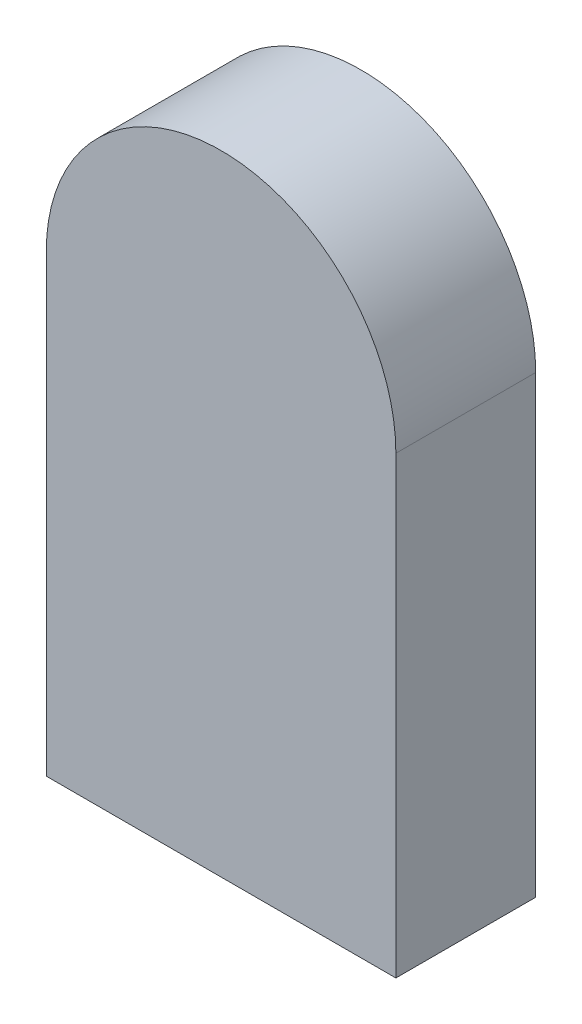
ISO-10303-21;
HEADER;
FILE_DESCRIPTION(('STEP AP214'),'2;1');
FILE_NAME('part.step','',(''),(''),'','','');
FILE_SCHEMA(('AUTOMOTIVE_DESIGN { 1 0 10303 214 1 1 1 1 }'));
ENDSEC;
DATA;
#1=APPLICATION_CONTEXT('core data for automotive mechanical design processes');
#2=APPLICATION_PROTOCOL_DEFINITION('international standard','automotive_design',2000,#1);
#3=PRODUCT_CONTEXT('',#1,'mechanical');
#4=PRODUCT('Part','Part','',(#3));
#5=PRODUCT_RELATED_PRODUCT_CATEGORY('part','',(#4));
#6=PRODUCT_DEFINITION_FORMATION('','',#4);
#7=PRODUCT_DEFINITION_CONTEXT('part definition',#1,'design');
#8=PRODUCT_DEFINITION('design','',#6,#7);
#9=PRODUCT_DEFINITION_SHAPE('','',#8);
#10=(LENGTH_UNIT() NAMED_UNIT(*) SI_UNIT(.MILLI.,.METRE.));
#11=(NAMED_UNIT(*) PLANE_ANGLE_UNIT() SI_UNIT($,.RADIAN.));
#12=(NAMED_UNIT(*) SI_UNIT($,.STERADIAN.) SOLID_ANGLE_UNIT());
#13=UNCERTAINTY_MEASURE_WITH_UNIT(LENGTH_MEASURE(1.E-05),#10,'distance_accuracy_value','');
#14=(GEOMETRIC_REPRESENTATION_CONTEXT(3) GLOBAL_UNCERTAINTY_ASSIGNED_CONTEXT((#13)) GLOBAL_UNIT_ASSIGNED_CONTEXT((#10,
#11,#12)) REPRESENTATION_CONTEXT('',''));
#15=CARTESIAN_POINT('',(0.,0.,0.));
#16=DIRECTION('',(0.,0.,1.));
#17=DIRECTION('',(1.,0.,0.));
#18=AXIS2_PLACEMENT_3D('',#15,#16,#17);
#19=CARTESIAN_POINT('',(-0.375,-2.05,0.));
#20=DIRECTION('',(0.,1.,0.));
#21=DIRECTION('',(1.,0.,0.));
#22=AXIS2_PLACEMENT_3D('',#19,#20,#21);
#23=PLANE('',#22);
#24=DIRECTION('',(1.,0.,0.));
#25=VECTOR('',#24,1.);
#26=CARTESIAN_POINT('',(-0.375,-2.05,0.));
#27=LINE('',#26,#25);
#28=CARTESIAN_POINT('',(-0.375,-2.05,0.));
#29=VERTEX_POINT('',#28);
#30=CARTESIAN_POINT('',(-0.125,-2.05,0.));
#31=VERTEX_POINT('',#30);
#32=EDGE_CURVE('E11',#29,#31,#27,.T.);
#33=ORIENTED_EDGE('',*,*,#32,.T.);
#34=DIRECTION('',(0.,0.,1.));
#35=VECTOR('',#34,1.);
#36=CARTESIAN_POINT('',(-0.125,-2.05,0.));
#37=LINE('',#36,#35);
#38=CARTESIAN_POINT('',(-0.125,-2.05,0.1));
#39=VERTEX_POINT('',#38);
#40=EDGE_CURVE('E24',#31,#39,#37,.T.);
#41=ORIENTED_EDGE('',*,*,#40,.T.);
#42=DIRECTION('',(1.,0.,0.));
#43=VECTOR('',#42,1.);
#44=CARTESIAN_POINT('',(-0.375,-2.05,0.1));
#45=LINE('',#44,#43);
#46=CARTESIAN_POINT('',(-0.375,-2.05,0.1));
#47=VERTEX_POINT('',#46);
#48=EDGE_CURVE('E87',#47,#39,#45,.T.);
#49=ORIENTED_EDGE('',*,*,#48,.F.);
#50=DIRECTION('',(0.,0.,1.));
#51=VECTOR('',#50,1.);
#52=CARTESIAN_POINT('',(-0.375,-2.05,0.));
#53=LINE('',#52,#51);
#54=EDGE_CURVE('E36',#29,#47,#53,.T.);
#55=ORIENTED_EDGE('',*,*,#54,.F.);
#56=EDGE_LOOP('',(#33,#41,#49,#55));
#57=FACE_BOUND('',#56,.T.);
#58=ADVANCED_FACE('F17',(#57),#23,.F.);
#59=CARTESIAN_POINT('',(-0.125,-2.05,0.));
#60=DIRECTION('',(-1.,0.,0.));
#61=DIRECTION('',(0.,1.,0.));
#62=AXIS2_PLACEMENT_3D('',#59,#60,#61);
#63=PLANE('',#62);
#64=DIRECTION('',(0.,1.,0.));
#65=VECTOR('',#64,1.);
#66=CARTESIAN_POINT('',(-0.125,-2.05,0.));
#67=LINE('',#66,#65);
#68=CARTESIAN_POINT('',(-0.125,-1.725,0.));
#69=VERTEX_POINT('',#68);
#70=EDGE_CURVE('E84',#31,#69,#67,.T.);
#71=ORIENTED_EDGE('',*,*,#70,.T.);
#72=DIRECTION('',(0.,0.,1.));
#73=VECTOR('',#72,1.);
#74=CARTESIAN_POINT('',(-0.125,-1.725,0.));
#75=LINE('',#74,#73);
#76=CARTESIAN_POINT('',(-0.125,-1.725,0.1));
#77=VERTEX_POINT('',#76);
#78=EDGE_CURVE('E82',#69,#77,#75,.T.);
#79=ORIENTED_EDGE('',*,*,#78,.T.);
#80=DIRECTION('',(0.,1.,0.));
#81=VECTOR('',#80,1.);
#82=CARTESIAN_POINT('',(-0.125,-2.05,0.1));
#83=LINE('',#82,#81);
#84=EDGE_CURVE('E72',#39,#77,#83,.T.);
#85=ORIENTED_EDGE('',*,*,#84,.F.);
#86=ORIENTED_EDGE('',*,*,#40,.F.);
#87=EDGE_LOOP('',(#71,#79,#85,#86));
#88=FACE_BOUND('',#87,.T.);
#89=ADVANCED_FACE('F89',(#88),#63,.F.);
#90=CARTESIAN_POINT('',(-0.25,-1.725,0.));
#91=DIRECTION('',(0.,0.,-1.));
#92=DIRECTION('',(1.,0.,0.));
#93=AXIS2_PLACEMENT_3D('',#90,#91,#92);
#94=CYLINDRICAL_SURFACE('',#93,0.125);
#95=CARTESIAN_POINT('',(-0.25,-1.725,0.));
#96=DIRECTION('',(0.,0.,1.));
#97=DIRECTION('',(1.,0.,0.));
#98=AXIS2_PLACEMENT_3D('',#95,#96,#97);
#99=CIRCLE('',#98,0.125);
#100=CARTESIAN_POINT('',(-0.375,-1.725,0.));
#101=VERTEX_POINT('',#100);
#102=EDGE_CURVE('E62',#69,#101,#99,.T.);
#103=ORIENTED_EDGE('',*,*,#102,.T.);
#104=DIRECTION('',(0.,0.,1.));
#105=VECTOR('',#104,1.);
#106=CARTESIAN_POINT('',(-0.375,-1.725,0.));
#107=LINE('',#106,#105);
#108=CARTESIAN_POINT('',(-0.375,-1.725,0.1));
#109=VERTEX_POINT('',#108);
#110=EDGE_CURVE('E57',#101,#109,#107,.T.);
#111=ORIENTED_EDGE('',*,*,#110,.T.);
#112=CARTESIAN_POINT('',(-0.25,-1.725,0.1));
#113=DIRECTION('',(0.,0.,1.));
#114=DIRECTION('',(1.,0.,0.));
#115=AXIS2_PLACEMENT_3D('',#112,#113,#114);
#116=CIRCLE('',#115,0.125);
#117=EDGE_CURVE('E60',#77,#109,#116,.T.);
#118=ORIENTED_EDGE('',*,*,#117,.F.);
#119=ORIENTED_EDGE('',*,*,#78,.F.);
#120=EDGE_LOOP('',(#103,#111,#118,#119));
#121=FACE_BOUND('',#120,.T.);
#122=ADVANCED_FACE('F59',(#121),#94,.T.);
#123=CARTESIAN_POINT('',(-0.375,-2.05,0.));
#124=DIRECTION('',(-1.,0.,0.));
#125=DIRECTION('',(0.,1.,0.));
#126=AXIS2_PLACEMENT_3D('',#123,#124,#125);
#127=PLANE('',#126);
#128=ORIENTED_EDGE('',*,*,#54,.T.);
#129=DIRECTION('',(0.,1.,0.));
#130=VECTOR('',#129,1.);
#131=CARTESIAN_POINT('',(-0.375,-2.05,0.1));
#132=LINE('',#131,#130);
#133=EDGE_CURVE('E71',#47,#109,#132,.T.);
#134=ORIENTED_EDGE('',*,*,#133,.T.);
#135=ORIENTED_EDGE('',*,*,#110,.F.);
#136=DIRECTION('',(0.,1.,0.));
#137=VECTOR('',#136,1.);
#138=CARTESIAN_POINT('',(-0.375,-2.05,0.));
#139=LINE('',#138,#137);
#140=EDGE_CURVE('E76',#29,#101,#139,.T.);
#141=ORIENTED_EDGE('',*,*,#140,.F.);
#142=EDGE_LOOP('',(#128,#134,#135,#141));
#143=FACE_BOUND('',#142,.T.);
#144=ADVANCED_FACE('F75',(#143),#127,.T.);
#145=CARTESIAN_POINT('',(-0.25,-1.850342514613,0.));
#146=DIRECTION('',(0.,0.,1.));
#147=DIRECTION('',(1.,0.,0.));
#148=AXIS2_PLACEMENT_3D('',#145,#146,#147);
#149=PLANE('',#148);
#150=ORIENTED_EDGE('',*,*,#140,.T.);
#151=ORIENTED_EDGE('',*,*,#102,.F.);
#152=ORIENTED_EDGE('',*,*,#70,.F.);
#153=ORIENTED_EDGE('',*,*,#32,.F.);
#154=EDGE_LOOP('',(#150,#151,#152,#153));
#155=FACE_BOUND('',#154,.T.);
#156=ADVANCED_FACE('F91',(#155),#149,.F.);
#157=CARTESIAN_POINT('',(-0.25,-1.850342514613,0.1));
#158=DIRECTION('',(0.,0.,1.));
#159=DIRECTION('',(1.,0.,0.));
#160=AXIS2_PLACEMENT_3D('',#157,#158,#159);
#161=PLANE('',#160);
#162=ORIENTED_EDGE('',*,*,#48,.T.);
#163=ORIENTED_EDGE('',*,*,#84,.T.);
#164=ORIENTED_EDGE('',*,*,#117,.T.);
#165=ORIENTED_EDGE('',*,*,#133,.F.);
#166=EDGE_LOOP('',(#162,#163,#164,#165));
#167=FACE_BOUND('',#166,.T.);
#168=ADVANCED_FACE('F70',(#167),#161,.T.);
#169=CLOSED_SHELL('',(#58,#89,#122,#144,#156,#168));
#170=MANIFOLD_SOLID_BREP('B1',#169);
#171=ADVANCED_BREP_SHAPE_REPRESENTATION('',(#18,#170),#14);
#172=SHAPE_DEFINITION_REPRESENTATION(#9,#171);
ENDSEC;
END-ISO-10303-21;
